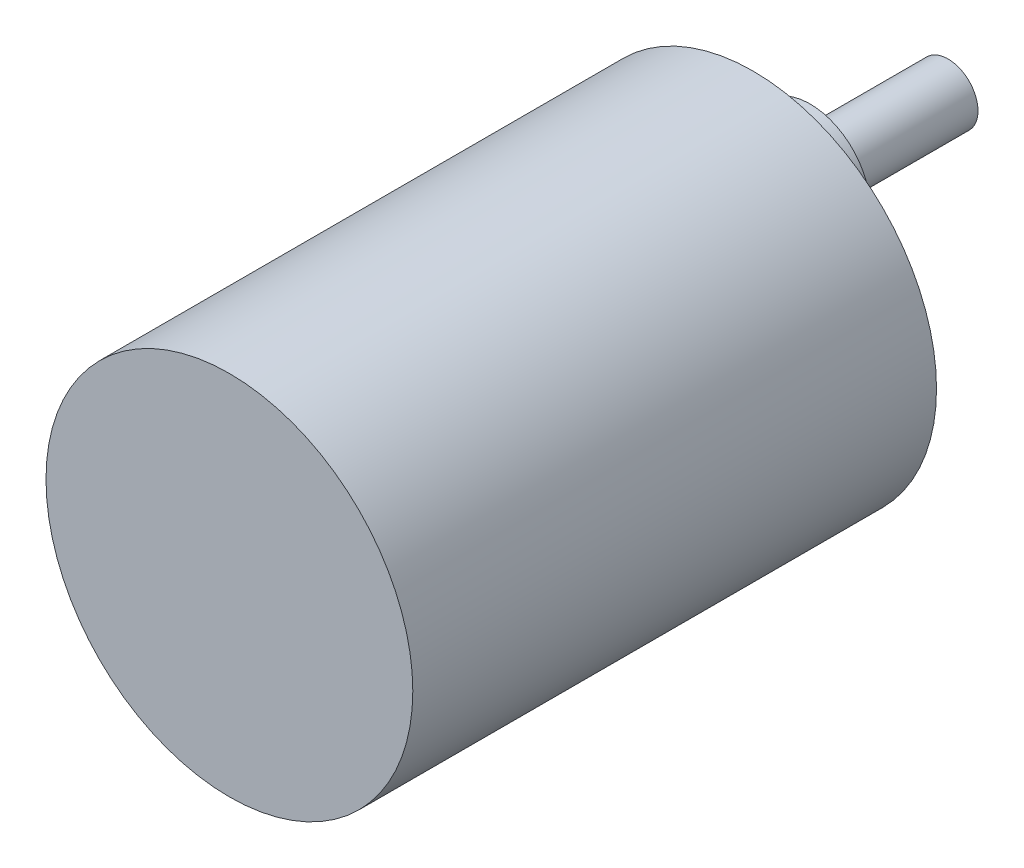
ISO-10303-21;
HEADER;
FILE_DESCRIPTION(('STEP AP214'),'2;1');
FILE_NAME('part.step','',(''),(''),'','','');
FILE_SCHEMA(('AUTOMOTIVE_DESIGN { 1 0 10303 214 1 1 1 1 }'));
ENDSEC;
DATA;
#1=APPLICATION_CONTEXT('core data for automotive mechanical design processes');
#2=APPLICATION_PROTOCOL_DEFINITION('international standard','automotive_design',2000,#1);
#3=PRODUCT_CONTEXT('',#1,'mechanical');
#4=PRODUCT('Part','Part','',(#3));
#5=PRODUCT_RELATED_PRODUCT_CATEGORY('part','',(#4));
#6=PRODUCT_DEFINITION_FORMATION('','',#4);
#7=PRODUCT_DEFINITION_CONTEXT('part definition',#1,'design');
#8=PRODUCT_DEFINITION('design','',#6,#7);
#9=PRODUCT_DEFINITION_SHAPE('','',#8);
#10=(LENGTH_UNIT() NAMED_UNIT(*) SI_UNIT(.MILLI.,.METRE.));
#11=(NAMED_UNIT(*) PLANE_ANGLE_UNIT() SI_UNIT($,.RADIAN.));
#12=(NAMED_UNIT(*) SI_UNIT($,.STERADIAN.) SOLID_ANGLE_UNIT());
#13=UNCERTAINTY_MEASURE_WITH_UNIT(LENGTH_MEASURE(1.E-05),#10,'distance_accuracy_value','');
#14=(GEOMETRIC_REPRESENTATION_CONTEXT(3) GLOBAL_UNCERTAINTY_ASSIGNED_CONTEXT((#13)) GLOBAL_UNIT_ASSIGNED_CONTEXT((#10,
#11,#12)) REPRESENTATION_CONTEXT('',''));
#15=CARTESIAN_POINT('',(0.,0.,0.));
#16=DIRECTION('',(0.,0.,1.));
#17=DIRECTION('',(1.,0.,0.));
#18=AXIS2_PLACEMENT_3D('',#15,#16,#17);
#19=CARTESIAN_POINT('',(0.,0.,52.4));
#20=DIRECTION('',(0.,0.,-1.));
#21=DIRECTION('',(-1.,0.,0.));
#22=AXIS2_PLACEMENT_3D('',#19,#20,#21);
#23=CYLINDRICAL_SURFACE('',#22,18.35);
#24=CARTESIAN_POINT('',(0.,0.,52.4));
#25=DIRECTION('',(0.,0.,1.));
#26=DIRECTION('',(1.,0.,0.));
#27=AXIS2_PLACEMENT_3D('',#24,#25,#26);
#28=CIRCLE('',#27,18.35);
#29=CARTESIAN_POINT('',(18.35,0.,52.4));
#30=VERTEX_POINT('',#29);
#31=EDGE_CURVE('E10',#30,#30,#28,.T.);
#32=ORIENTED_EDGE('',*,*,#31,.F.);
#33=EDGE_LOOP('',(#32));
#34=FACE_BOUND('',#33,.T.);
#35=CARTESIAN_POINT('',(0.,0.,0.));
#36=DIRECTION('',(0.,0.,1.));
#37=DIRECTION('',(1.,0.,0.));
#38=AXIS2_PLACEMENT_3D('',#35,#36,#37);
#39=CIRCLE('',#38,18.35);
#40=CARTESIAN_POINT('',(18.35,0.,0.));
#41=VERTEX_POINT('',#40);
#42=EDGE_CURVE('E43',#41,#41,#39,.T.);
#43=ORIENTED_EDGE('',*,*,#42,.T.);
#44=EDGE_LOOP('',(#43));
#45=FACE_BOUND('',#44,.T.);
#46=ADVANCED_FACE('F36',(#34,#45),#23,.T.);
#47=CARTESIAN_POINT('',(0.,0.,52.4));
#48=DIRECTION('',(0.,0.,1.));
#49=DIRECTION('',(1.,0.,0.));
#50=AXIS2_PLACEMENT_3D('',#47,#48,#49);
#51=PLANE('',#50);
#52=ORIENTED_EDGE('',*,*,#31,.T.);
#53=EDGE_LOOP('',(#52));
#54=FACE_BOUND('',#53,.T.);
#55=ADVANCED_FACE('F83',(#54),#51,.T.);
#56=CARTESIAN_POINT('',(0.,0.,0.));
#57=DIRECTION('',(0.,0.,1.));
#58=DIRECTION('',(1.,0.,0.));
#59=AXIS2_PLACEMENT_3D('',#56,#57,#58);
#60=PLANE('',#59);
#61=CARTESIAN_POINT('',(-15.5,0.,0.));
#62=DIRECTION('',(0.,0.,1.));
#63=DIRECTION('',(1.,0.,0.));
#64=AXIS2_PLACEMENT_3D('',#61,#62,#63);
#65=CIRCLE('',#64,1.5);
#66=CARTESIAN_POINT('',(-14.,0.,0.));
#67=VERTEX_POINT('',#66);
#68=EDGE_CURVE('E65',#67,#67,#65,.T.);
#69=ORIENTED_EDGE('',*,*,#68,.T.);
#70=EDGE_LOOP('',(#69));
#71=FACE_BOUND('',#70,.T.);
#72=CARTESIAN_POINT('',(15.5,0.,0.));
#73=DIRECTION('',(0.,0.,1.));
#74=DIRECTION('',(1.,0.,0.));
#75=AXIS2_PLACEMENT_3D('',#72,#73,#74);
#76=CIRCLE('',#75,1.5);
#77=CARTESIAN_POINT('',(17.,0.,0.));
#78=VERTEX_POINT('',#77);
#79=EDGE_CURVE('E62',#78,#78,#76,.T.);
#80=ORIENTED_EDGE('',*,*,#79,.T.);
#81=EDGE_LOOP('',(#80));
#82=FACE_BOUND('',#81,.T.);
#83=CARTESIAN_POINT('',(0.,6.65,0.));
#84=DIRECTION('',(0.,0.,1.));
#85=DIRECTION('',(1.,0.,0.));
#86=AXIS2_PLACEMENT_3D('',#83,#84,#85);
#87=CIRCLE('',#86,6.);
#88=CARTESIAN_POINT('',(6.,6.65,0.));
#89=VERTEX_POINT('',#88);
#90=EDGE_CURVE('E50',#89,#89,#87,.T.);
#91=ORIENTED_EDGE('',*,*,#90,.T.);
#92=EDGE_LOOP('',(#91));
#93=FACE_BOUND('',#92,.T.);
#94=ORIENTED_EDGE('',*,*,#42,.F.);
#95=EDGE_LOOP('',(#94));
#96=FACE_BOUND('',#95,.T.);
#97=ADVANCED_FACE('F88',(#71,#82,#93,#96),#60,.F.);
#98=CARTESIAN_POINT('',(0.,6.65,-5.7));
#99=DIRECTION('',(0.,0.,1.));
#100=DIRECTION('',(1.,0.,0.));
#101=AXIS2_PLACEMENT_3D('',#98,#99,#100);
#102=CYLINDRICAL_SURFACE('',#101,6.);
#103=CARTESIAN_POINT('',(0.,6.65,-5.7));
#104=DIRECTION('',(0.,0.,1.));
#105=DIRECTION('',(1.,0.,0.));
#106=AXIS2_PLACEMENT_3D('',#103,#104,#105);
#107=CIRCLE('',#106,6.);
#108=CARTESIAN_POINT('',(6.,6.65,-5.7));
#109=VERTEX_POINT('',#108);
#110=EDGE_CURVE('E48',#109,#109,#107,.T.);
#111=ORIENTED_EDGE('',*,*,#110,.T.);
#112=EDGE_LOOP('',(#111));
#113=FACE_BOUND('',#112,.T.);
#114=ORIENTED_EDGE('',*,*,#90,.F.);
#115=EDGE_LOOP('',(#114));
#116=FACE_BOUND('',#115,.T.);
#117=ADVANCED_FACE('F94',(#113,#116),#102,.T.);
#118=CARTESIAN_POINT('',(0.,6.65,-5.7));
#119=DIRECTION('',(0.,0.,1.));
#120=DIRECTION('',(1.,0.,0.));
#121=AXIS2_PLACEMENT_3D('',#118,#119,#120);
#122=PLANE('',#121);
#123=CARTESIAN_POINT('',(0.,6.65,-5.7));
#124=DIRECTION('',(0.,0.,1.));
#125=DIRECTION('',(1.,0.,0.));
#126=AXIS2_PLACEMENT_3D('',#123,#124,#125);
#127=CIRCLE('',#126,3.);
#128=CARTESIAN_POINT('',(3.,6.65,-5.7));
#129=VERTEX_POINT('',#128);
#130=EDGE_CURVE('E39',#129,#129,#127,.T.);
#131=ORIENTED_EDGE('',*,*,#130,.T.);
#132=EDGE_LOOP('',(#131));
#133=FACE_BOUND('',#132,.T.);
#134=ORIENTED_EDGE('',*,*,#110,.F.);
#135=EDGE_LOOP('',(#134));
#136=FACE_BOUND('',#135,.T.);
#137=ADVANCED_FACE('F99',(#133,#136),#122,.F.);
#138=CARTESIAN_POINT('',(0.,6.65,-19.5));
#139=DIRECTION('',(0.,0.,1.));
#140=DIRECTION('',(1.,0.,0.));
#141=AXIS2_PLACEMENT_3D('',#138,#139,#140);
#142=CYLINDRICAL_SURFACE('',#141,3.);
#143=CARTESIAN_POINT('',(0.,6.65,-19.5));
#144=DIRECTION('',(0.,0.,1.));
#145=DIRECTION('',(1.,0.,0.));
#146=AXIS2_PLACEMENT_3D('',#143,#144,#145);
#147=CIRCLE('',#146,3.);
#148=CARTESIAN_POINT('',(3.,6.65,-19.5));
#149=VERTEX_POINT('',#148);
#150=EDGE_CURVE('E55',#149,#149,#147,.T.);
#151=ORIENTED_EDGE('',*,*,#150,.T.);
#152=EDGE_LOOP('',(#151));
#153=FACE_BOUND('',#152,.T.);
#154=ORIENTED_EDGE('',*,*,#130,.F.);
#155=EDGE_LOOP('',(#154));
#156=FACE_BOUND('',#155,.T.);
#157=ADVANCED_FACE('F106',(#153,#156),#142,.T.);
#158=CARTESIAN_POINT('',(0.,0.,-19.5));
#159=DIRECTION('',(0.,0.,1.));
#160=DIRECTION('',(1.,0.,0.));
#161=AXIS2_PLACEMENT_3D('',#158,#159,#160);
#162=PLANE('',#161);
#163=ORIENTED_EDGE('',*,*,#150,.F.);
#164=EDGE_LOOP('',(#163));
#165=FACE_BOUND('',#164,.T.);
#166=ADVANCED_FACE('F110',(#165),#162,.F.);
#167=CARTESIAN_POINT('',(15.5,0.,3.));
#168=DIRECTION('',(0.,0.,-1.));
#169=DIRECTION('',(-1.,0.,0.));
#170=AXIS2_PLACEMENT_3D('',#167,#168,#169);
#171=CYLINDRICAL_SURFACE('',#170,1.5);
#172=CARTESIAN_POINT('',(15.5,0.,3.));
#173=DIRECTION('',(0.,0.,1.));
#174=DIRECTION('',(1.,0.,0.));
#175=AXIS2_PLACEMENT_3D('',#172,#173,#174);
#176=CIRCLE('',#175,1.5);
#177=CARTESIAN_POINT('',(17.,0.,3.));
#178=VERTEX_POINT('',#177);
#179=EDGE_CURVE('E59',#178,#178,#176,.T.);
#180=ORIENTED_EDGE('',*,*,#179,.T.);
#181=EDGE_LOOP('',(#180));
#182=FACE_BOUND('',#181,.T.);
#183=ORIENTED_EDGE('',*,*,#79,.F.);
#184=EDGE_LOOP('',(#183));
#185=FACE_BOUND('',#184,.T.);
#186=ADVANCED_FACE('F114',(#182,#185),#171,.F.);
#187=CARTESIAN_POINT('',(15.5,0.,3.));
#188=DIRECTION('',(0.,0.,1.));
#189=DIRECTION('',(1.,0.,0.));
#190=AXIS2_PLACEMENT_3D('',#187,#188,#189);
#191=PLANE('',#190);
#192=ORIENTED_EDGE('',*,*,#179,.F.);
#193=EDGE_LOOP('',(#192));
#194=FACE_BOUND('',#193,.T.);
#195=ADVANCED_FACE('F80',(#194),#191,.F.);
#196=CARTESIAN_POINT('',(-15.5,0.,3.));
#197=DIRECTION('',(0.,0.,-1.));
#198=DIRECTION('',(-1.,0.,0.));
#199=AXIS2_PLACEMENT_3D('',#196,#197,#198);
#200=CYLINDRICAL_SURFACE('',#199,1.5);
#201=CARTESIAN_POINT('',(-15.5,0.,3.));
#202=DIRECTION('',(0.,0.,1.));
#203=DIRECTION('',(1.,0.,0.));
#204=AXIS2_PLACEMENT_3D('',#201,#202,#203);
#205=CIRCLE('',#204,1.5);
#206=CARTESIAN_POINT('',(-14.,0.,3.));
#207=VERTEX_POINT('',#206);
#208=EDGE_CURVE('E58',#207,#207,#205,.T.);
#209=ORIENTED_EDGE('',*,*,#208,.T.);
#210=EDGE_LOOP('',(#209));
#211=FACE_BOUND('',#210,.T.);
#212=ORIENTED_EDGE('',*,*,#68,.F.);
#213=EDGE_LOOP('',(#212));
#214=FACE_BOUND('',#213,.T.);
#215=ADVANCED_FACE('F71',(#211,#214),#200,.F.);
#216=CARTESIAN_POINT('',(-15.5,0.,3.));
#217=DIRECTION('',(0.,0.,1.));
#218=DIRECTION('',(1.,0.,0.));
#219=AXIS2_PLACEMENT_3D('',#216,#217,#218);
#220=PLANE('',#219);
#221=ORIENTED_EDGE('',*,*,#208,.F.);
#222=EDGE_LOOP('',(#221));
#223=FACE_BOUND('',#222,.T.);
#224=ADVANCED_FACE('F74',(#223),#220,.F.);
#225=CLOSED_SHELL('',(#46,#55,#97,#117,#137,#157,#166,#186,#195,#215,#224));
#226=MANIFOLD_SOLID_BREP('B2',#225);
#227=ADVANCED_BREP_SHAPE_REPRESENTATION('',(#18,#226),#14);
#228=SHAPE_DEFINITION_REPRESENTATION(#9,#227);
ENDSEC;
END-ISO-10303-21;
